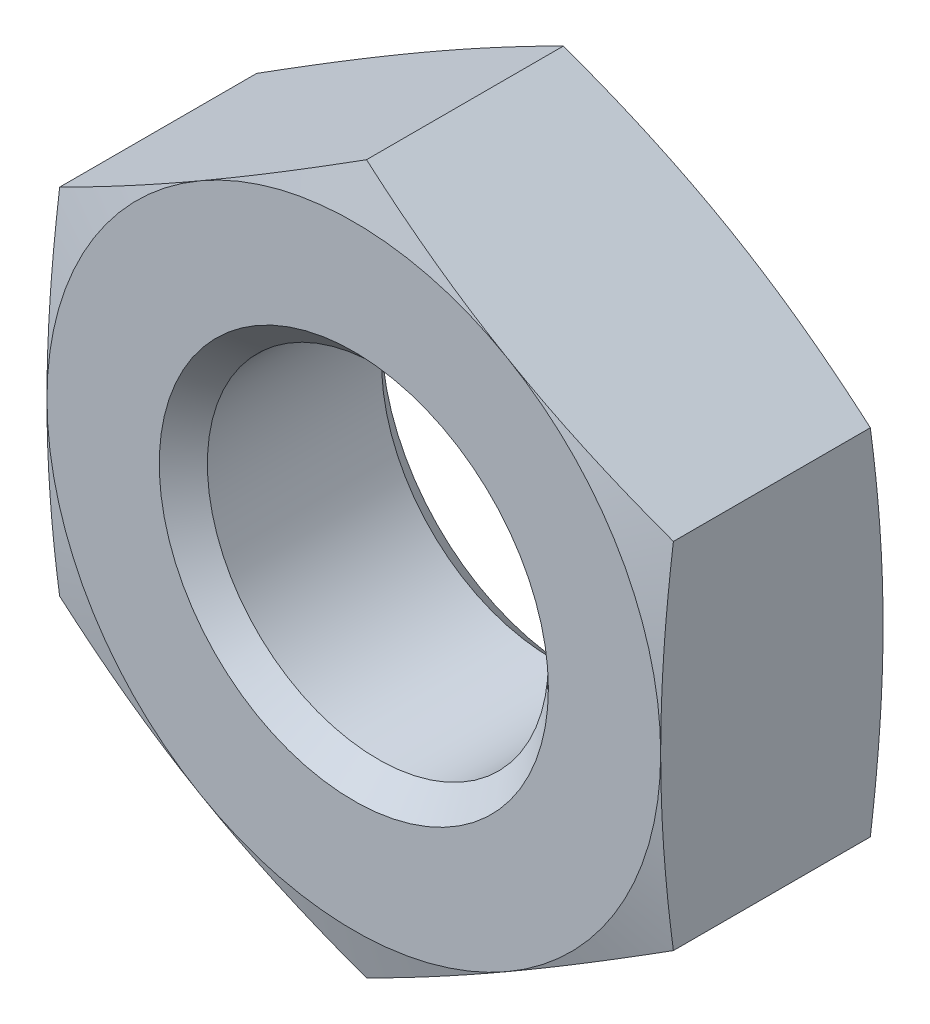
ISO-10303-21;
HEADER;
FILE_DESCRIPTION(('STEP AP214'),'2;1');
FILE_NAME('part.step','',(''),(''),'','','');
FILE_SCHEMA(('AUTOMOTIVE_DESIGN { 1 0 10303 214 1 1 1 1 }'));
ENDSEC;
DATA;
#1=APPLICATION_CONTEXT('core data for automotive mechanical design processes');
#2=APPLICATION_PROTOCOL_DEFINITION('international standard','automotive_design',2000,#1);
#3=PRODUCT_CONTEXT('',#1,'mechanical');
#4=PRODUCT('Part','Part','',(#3));
#5=PRODUCT_RELATED_PRODUCT_CATEGORY('part','',(#4));
#6=PRODUCT_DEFINITION_FORMATION('','',#4);
#7=PRODUCT_DEFINITION_CONTEXT('part definition',#1,'design');
#8=PRODUCT_DEFINITION('design','',#6,#7);
#9=PRODUCT_DEFINITION_SHAPE('','',#8);
#10=(LENGTH_UNIT() NAMED_UNIT(*) SI_UNIT(.MILLI.,.METRE.));
#11=(NAMED_UNIT(*) PLANE_ANGLE_UNIT() SI_UNIT($,.RADIAN.));
#12=(NAMED_UNIT(*) SI_UNIT($,.STERADIAN.) SOLID_ANGLE_UNIT());
#13=UNCERTAINTY_MEASURE_WITH_UNIT(LENGTH_MEASURE(1.E-05),#10,'distance_accuracy_value','');
#14=(GEOMETRIC_REPRESENTATION_CONTEXT(3) GLOBAL_UNCERTAINTY_ASSIGNED_CONTEXT((#13)) GLOBAL_UNIT_ASSIGNED_CONTEXT((#10,
#11,#12)) REPRESENTATION_CONTEXT('',''));
#15=CARTESIAN_POINT('',(0.,0.,0.));
#16=DIRECTION('',(0.,0.,1.));
#17=DIRECTION('',(1.,0.,0.));
#18=AXIS2_PLACEMENT_3D('',#15,#16,#17);
#19=CARTESIAN_POINT('',(0.,0.,-0.46960775465478));
#20=DIRECTION('',(0.,0.,-1.));
#21=DIRECTION('',(-1.,0.,0.));
#22=AXIS2_PLACEMENT_3D('',#19,#20,#21);
#23=CONICAL_SURFACE('',#22,10.5156,1.30899693899575);
#24=CARTESIAN_POINT('',(-8.763,-13.3837702899199,-1.93844049434777));
#25=CARTESIAN_POINT('',(-8.763,-12.9862181649756,-1.84934412146664));
#26=CARTESIAN_POINT('',(-8.763,-12.5884173836727,-1.76133740130551));
#27=CARTESIAN_POINT('',(-8.763,-11.792196389762,-1.58809143425452));
#28=CARTESIAN_POINT('',(-8.763,-11.3937761511781,-1.50285230688892));
#29=CARTESIAN_POINT('',(-8.763,-10.5958372220428,-1.33565551527808));
#30=CARTESIAN_POINT('',(-8.763,-10.1963178373504,-1.2537011520015));
#31=CARTESIAN_POINT('',(-8.763,-9.39644750668763,-1.09395849709296));
#32=CARTESIAN_POINT('',(-8.763,-8.99609656776501,-1.0161701703002));
#33=CARTESIAN_POINT('',(-8.763,-8.19761138133054,-0.866351145193688));
#34=CARTESIAN_POINT('',(-8.763,-7.7994848436043,-0.794279558247119));
#35=CARTESIAN_POINT('',(-8.763,-7.00214580050872,-0.656428589692995));
#36=CARTESIAN_POINT('',(-8.763,-6.60293331923369,-0.590649069632863));
#37=CARTESIAN_POINT('',(-8.763,-5.80334489207022,-0.466863323728334));
#38=CARTESIAN_POINT('',(-8.763,-5.40296909562369,-0.408856140943656));
#39=CARTESIAN_POINT('',(-8.763,-4.60094342795015,-0.302324446329907));
#40=CARTESIAN_POINT('',(-8.763,-4.19929355552988,-0.253799943384739));
#41=CARTESIAN_POINT('',(-8.763,-3.39018837962683,-0.167607648360078));
#42=CARTESIAN_POINT('',(-8.763,-2.98271903379171,-0.130069718559839));
#43=CARTESIAN_POINT('',(-8.763,-2.16675595793937,-0.0684401455251191));
#44=CARTESIAN_POINT('',(-8.763,-1.75826225163068,-0.0443481939203276));
#45=CARTESIAN_POINT('',(-8.763,-0.940843012454314,-0.0110157171231371));
#46=CARTESIAN_POINT('',(-8.763,-0.531917760453649,-0.00176844288722009));
#47=CARTESIAN_POINT('',(-8.763,0.285991550994262,0.00130613861734006));
#48=CARTESIAN_POINT('',(-8.763,0.694975610390509,-0.00486654082138649));
#49=CARTESIAN_POINT('',(-8.763,1.51391612064036,-0.0322847373045139));
#50=CARTESIAN_POINT('',(-8.763,1.92387070253099,-0.0535849596048437));
#51=CARTESIAN_POINT('',(-8.763,2.74281574927551,-0.110042389929746));
#52=CARTESIAN_POINT('',(-8.763,3.15180619258268,-0.145199904740592));
#53=CARTESIAN_POINT('',(-8.763,3.96881951949812,-0.22759601433524));
#54=CARTESIAN_POINT('',(-8.763,4.37684159561712,-0.27484249329322));
#55=CARTESIAN_POINT('',(-8.763,5.19157263502939,-0.379450538965934));
#56=CARTESIAN_POINT('',(-8.763,5.59828159419586,-0.436812137438485));
#57=CARTESIAN_POINT('',(-8.763,6.38354017699799,-0.555743213369239));
#58=CARTESIAN_POINT('',(-8.763,6.76217092727843,-0.616782449788006));
#59=CARTESIAN_POINT('',(-8.763,7.51843456139871,-0.744785447310177));
#60=CARTESIAN_POINT('',(-8.763,7.89606741772422,-0.81174937005183));
#61=CARTESIAN_POINT('',(-8.763,8.65047296826483,-0.950519483254617));
#62=CARTESIAN_POINT('',(-8.763,9.02724558226135,-1.02232610765112));
#63=CARTESIAN_POINT('',(-8.763,9.78001835031701,-1.16989133180626));
#64=CARTESIAN_POINT('',(-8.763,10.1560184943023,-1.24564998276803));
#65=CARTESIAN_POINT('',(-8.763,10.9074351141636,-1.40042140295396));
#66=CARTESIAN_POINT('',(-8.763,11.2828514390693,-1.47943490312786));
#67=CARTESIAN_POINT('',(-8.763,12.0331126862545,-1.64013356208892));
#68=CARTESIAN_POINT('',(-8.763,12.4079576051979,-1.72181873641227));
#69=CARTESIAN_POINT('',(-8.763,13.5317125358089,-1.97016081007156));
#70=CARTESIAN_POINT('',(-8.763,14.279893613434,-2.14011488200832));
#71=CARTESIAN_POINT('',(-8.763,15.7674818810842,-2.48445565533592));
#72=CARTESIAN_POINT('',(-8.763,16.5069030435853,-2.65878238911854));
#73=CARTESIAN_POINT('',(-8.763,17.9847143075208,-3.01180428588832));
#74=CARTESIAN_POINT('',(-8.763,18.7231043899121,-3.19049952845809));
#75=CARTESIAN_POINT('',(-8.763,20.1981842908095,-3.5508912153922));
#76=CARTESIAN_POINT('',(-8.763,20.9348750830499,-3.73258368406784));
#77=CARTESIAN_POINT('',(-8.763,22.4076149635126,-4.09844959544106));
#78=CARTESIAN_POINT('',(-8.763,23.1436640721096,-4.2826229560661));
#79=CARTESIAN_POINT('',(-8.763,23.8794895947639,-4.46767540457424));
#80=B_SPLINE_CURVE_WITH_KNOTS('',3,(#24,#25,#26,#27,#28,#29,#30,#31,#32,#33,#34,#35,#36,#37,#38,
#39,#40,#41,#42,#43,#44,#45,#46,#47,#48,#49,#50,#51,#52,#53,#54,#55,#56,#57,#58,#59,#60,#61,#62,
#63,#64,#65,#66,#67,#68,#69,#70,#71,#72,#73,#74,#75,#76,#77,#78,#79),.UNSPECIFIED.,.F.,.F.,(4,2,
2,2,2,2,2,2,2,2,2,2,2,2,2,2,2,2,2,2,2,2,2,2,2,2,2,4),(0.,1.22224582683769,2.44454436889226,
3.66804192292283,4.89152914916844,6.10528101679588,7.31900617050677,8.53258175121245,
9.74615846885785,10.9735486088279,12.2009105986532,13.4277144175138,14.6545171788198,
15.8857791275233,17.1170683366373,18.3491626232361,19.5812607782343,20.7317631716272,
21.8822969628969,23.0329339862866,24.183585921232,25.3344976849745,26.4854161426325,
28.7870971026554,31.0661607154404,33.345265877679,35.6215585602892,37.8977761229223),.UNSPECIFIED.);
#81=CARTESIAN_POINT('',(-8.763,-5.0593204089087,-0.363242862360831));
#82=VERTEX_POINT('',#81);
#83=CARTESIAN_POINT('',(-8.763,0.,0.));
#84=VERTEX_POINT('',#83);
#85=EDGE_CURVE('E276',#82,#84,#80,.T.);
#86=ORIENTED_EDGE('',*,*,#85,.F.);
#87=CARTESIAN_POINT('',(0.0002,-10.1187562878708,-0.363273802998012));
#88=CARTESIAN_POINT('',(-0.363721959861376,-9.90864584638087,-0.306951649740606));
#89=CARTESIAN_POINT('',(-0.728303743849241,-9.69815445525386,-0.25582046240115));
#90=CARTESIAN_POINT('',(-1.45875483719337,-9.2764283198818,-0.165987801407371));
#91=CARTESIAN_POINT('',(-1.82462460868095,-9.06519330882512,-0.127291376259173));
#92=CARTESIAN_POINT('',(-2.55543344890334,-8.64326062819659,-0.064587273673505));
#93=CARTESIAN_POINT('',(-2.92036757610492,-8.4325658116203,-0.0405048202732206));
#94=CARTESIAN_POINT('',(-3.65070120469056,-8.01090749455818,-0.00821271888188956));
#95=CARTESIAN_POINT('',(-4.01610060234528,-7.79994405396051,0.));
#96=CARTESIAN_POINT('',(-4.74689939765473,-7.37801717276518,0.));
#97=CARTESIAN_POINT('',(-5.11229879530945,-7.16705373216752,-0.00821271888191001));
#98=CARTESIAN_POINT('',(-5.84263242389508,-6.7453954151054,-0.0405048202732604));
#99=CARTESIAN_POINT('',(-6.20756655109666,-6.5347005985291,-0.064587273673554));
#100=CARTESIAN_POINT('',(-6.93837539131905,-6.11276791790058,-0.127291376259239));
#101=CARTESIAN_POINT('',(-7.30424516280663,-5.9015329068439,-0.165987801407446));
#102=CARTESIAN_POINT('',(-8.03469625615076,-5.47980677147184,-0.255820462401241));
#103=CARTESIAN_POINT('',(-8.39927804013863,-5.26931538034483,-0.306951649740704));
#104=CARTESIAN_POINT('',(-8.7632,-5.05920493885486,-0.363273802998116));
#105=B_SPLINE_CURVE_WITH_KNOTS('',3,(#87,#88,#89,#90,#91,#92,#93,#94,#95,#96,#97,#98,#99,#100,
#101,#102,#103,#104),.UNSPECIFIED.,.F.,.F.,(4,2,2,2,2,2,2,2,4),(0.,1.27200216485818,
2.5445201112656,3.81047076613488,5.07617642725257,6.34188208837027,7.60783274323955,
8.88035068964697,10.1523528545051),.UNSPECIFIED.);
#106=CARTESIAN_POINT('',(-4.38149999999967,-7.58898061336304,0.));
#107=VERTEX_POINT('',#106);
#108=EDGE_CURVE('E152',#107,#82,#105,.T.);
#109=ORIENTED_EDGE('',*,*,#108,.F.);
#110=CARTESIAN_POINT('',(0.,0.,0.));
#111=DIRECTION('',(0.,0.,1.));
#112=DIRECTION('',(1.,0.,0.));
#113=AXIS2_PLACEMENT_3D('',#110,#111,#112);
#114=CIRCLE('',#113,8.763);
#115=EDGE_CURVE('E256',#84,#107,#114,.T.);
#116=ORIENTED_EDGE('',*,*,#115,.F.);
#117=EDGE_LOOP('',(#86,#109,#116));
#118=FACE_BOUND('',#117,.T.);
#119=ADVANCED_FACE('F33',(#118),#23,.T.);
#120=CARTESIAN_POINT('',(-8.763,5.0593204089087,-0.363242862360831));
#121=VERTEX_POINT('',#120);
#122=EDGE_CURVE('E273',#84,#121,#80,.T.);
#123=ORIENTED_EDGE('',*,*,#122,.F.);
#124=CARTESIAN_POINT('',(-4.38149999999967,7.58898061336304,0.));
#125=VERTEX_POINT('',#124);
#126=EDGE_CURVE('E257',#125,#84,#114,.T.);
#127=ORIENTED_EDGE('',*,*,#126,.F.);
#128=CARTESIAN_POINT('',(-8.7632,5.05920493885486,-0.363273802998116));
#129=CARTESIAN_POINT('',(-8.39927804013863,5.26931538034483,-0.306951649740704));
#130=CARTESIAN_POINT('',(-8.03469625615076,5.47980677147184,-0.255820462401241));
#131=CARTESIAN_POINT('',(-7.30424516280663,5.9015329068439,-0.165987801407446));
#132=CARTESIAN_POINT('',(-6.93837539131905,6.11276791790058,-0.127291376259239));
#133=CARTESIAN_POINT('',(-6.20756655109666,6.5347005985291,-0.0645872736735539));
#134=CARTESIAN_POINT('',(-5.84263242389508,6.7453954151054,-0.0405048202732603));
#135=CARTESIAN_POINT('',(-5.11229879530945,7.16705373216752,-0.00821271888190981));
#136=CARTESIAN_POINT('',(-4.74689939765473,7.37801717276518,0.));
#137=CARTESIAN_POINT('',(-4.01610060234528,7.79994405396051,0.));
#138=CARTESIAN_POINT('',(-3.65070120469056,8.01090749455818,-0.00821271888188968));
#139=CARTESIAN_POINT('',(-2.92036757610492,8.4325658116203,-0.0405048202732207));
#140=CARTESIAN_POINT('',(-2.55543344890334,8.64326062819659,-0.064587273673505));
#141=CARTESIAN_POINT('',(-1.82462460868095,9.06519330882512,-0.127291376259173));
#142=CARTESIAN_POINT('',(-1.45875483719337,9.2764283198818,-0.165987801407371));
#143=CARTESIAN_POINT('',(-0.72830374384924,9.69815445525386,-0.25582046240115));
#144=CARTESIAN_POINT('',(-0.363721959861375,9.90864584638087,-0.306951649740606));
#145=CARTESIAN_POINT('',(0.000200000000000236,10.1187562878708,-0.363273802998012));
#146=B_SPLINE_CURVE_WITH_KNOTS('',3,(#128,#129,#130,#131,#132,#133,#134,#135,#136,#137,#138,
#139,#140,#141,#142,#143,#144,#145),.UNSPECIFIED.,.F.,.F.,(4,2,2,2,2,2,2,2,4),(0.,
1.27200216485818,2.5445201112656,3.81047076613488,5.07617642725257,6.34188208837027,
7.60783274323955,8.88035068964697,10.1523528545051),.UNSPECIFIED.);
#147=EDGE_CURVE('E268',#121,#125,#146,.T.);
#148=ORIENTED_EDGE('',*,*,#147,.F.);
#149=EDGE_LOOP('',(#123,#127,#148));
#150=FACE_BOUND('',#149,.T.);
#151=ADVANCED_FACE('F222',(#150),#23,.T.);
#152=CARTESIAN_POINT('',(0.,10.118640817817,-0.363242862360727));
#153=VERTEX_POINT('',#152);
#154=EDGE_CURVE('E265',#125,#153,#146,.T.);
#155=ORIENTED_EDGE('',*,*,#154,.F.);
#156=CARTESIAN_POINT('',(4.38149999999967,7.58898061336304,0.));
#157=VERTEX_POINT('',#156);
#158=EDGE_CURVE('E41',#157,#125,#114,.T.);
#159=ORIENTED_EDGE('',*,*,#158,.F.);
#160=CARTESIAN_POINT('',(-0.0002,10.1187562878708,-0.363273802998012));
#161=CARTESIAN_POINT('',(0.363721959861376,9.90864584638087,-0.306951649740606));
#162=CARTESIAN_POINT('',(0.728303743849241,9.69815445525386,-0.25582046240115));
#163=CARTESIAN_POINT('',(1.45875483719337,9.2764283198818,-0.165987801407371));
#164=CARTESIAN_POINT('',(1.82462460868095,9.06519330882512,-0.127291376259173));
#165=CARTESIAN_POINT('',(2.55543344890334,8.64326062819659,-0.064587273673505));
#166=CARTESIAN_POINT('',(2.92036757610492,8.4325658116203,-0.0405048202732206));
#167=CARTESIAN_POINT('',(3.65070120469056,8.01090749455818,-0.00821271888188956));
#168=CARTESIAN_POINT('',(4.01610060234528,7.79994405396051,0.));
#169=CARTESIAN_POINT('',(4.74689939765473,7.37801717276518,0.));
#170=CARTESIAN_POINT('',(5.11229879530945,7.16705373216752,-0.00821271888191001));
#171=CARTESIAN_POINT('',(5.84263242389508,6.7453954151054,-0.0405048202732604));
#172=CARTESIAN_POINT('',(6.20756655109666,6.5347005985291,-0.064587273673554));
#173=CARTESIAN_POINT('',(6.93837539131905,6.11276791790058,-0.127291376259239));
#174=CARTESIAN_POINT('',(7.30424516280663,5.9015329068439,-0.165987801407446));
#175=CARTESIAN_POINT('',(8.03469625615076,5.47980677147184,-0.255820462401241));
#176=CARTESIAN_POINT('',(8.39927804013863,5.26931538034483,-0.306951649740704));
#177=CARTESIAN_POINT('',(8.7632,5.05920493885486,-0.363273802998116));
#178=B_SPLINE_CURVE_WITH_KNOTS('',3,(#160,#161,#162,#163,#164,#165,#166,#167,#168,#169,#170,
#171,#172,#173,#174,#175,#176,#177),.UNSPECIFIED.,.F.,.F.,(4,2,2,2,2,2,2,2,4),(0.,
1.27200216485818,2.5445201112656,3.81047076613488,5.07617642725257,6.34188208837027,
7.60783274323955,8.88035068964697,10.1523528545051),.UNSPECIFIED.);
#179=EDGE_CURVE('E264',#153,#157,#178,.T.);
#180=ORIENTED_EDGE('',*,*,#179,.F.);
#181=EDGE_LOOP('',(#155,#159,#180));
#182=FACE_BOUND('',#181,.T.);
#183=ADVANCED_FACE('F228',(#182),#23,.T.);
#184=CARTESIAN_POINT('',(8.763,5.0593204089087,-0.363242862360831));
#185=VERTEX_POINT('',#184);
#186=EDGE_CURVE('E326',#157,#185,#178,.T.);
#187=ORIENTED_EDGE('',*,*,#186,.F.);
#188=CARTESIAN_POINT('',(8.763,0.,0.));
#189=VERTEX_POINT('',#188);
#190=EDGE_CURVE('E11',#189,#157,#114,.T.);
#191=ORIENTED_EDGE('',*,*,#190,.F.);
#192=CARTESIAN_POINT('',(8.763,-13.3837702899199,-1.93844049434777));
#193=CARTESIAN_POINT('',(8.763,-12.9862181649756,-1.84934412146664));
#194=CARTESIAN_POINT('',(8.763,-12.5884173836727,-1.76133740130551));
#195=CARTESIAN_POINT('',(8.763,-11.792196389762,-1.58809143425452));
#196=CARTESIAN_POINT('',(8.763,-11.3937761511781,-1.50285230688892));
#197=CARTESIAN_POINT('',(8.763,-10.5958372220428,-1.33565551527808));
#198=CARTESIAN_POINT('',(8.763,-10.1963178373504,-1.2537011520015));
#199=CARTESIAN_POINT('',(8.763,-9.39644750668763,-1.09395849709296));
#200=CARTESIAN_POINT('',(8.763,-8.99609656776501,-1.0161701703002));
#201=CARTESIAN_POINT('',(8.763,-8.19761138133054,-0.866351145193688));
#202=CARTESIAN_POINT('',(8.763,-7.7994848436043,-0.794279558247119));
#203=CARTESIAN_POINT('',(8.763,-7.00214580050872,-0.656428589692995));
#204=CARTESIAN_POINT('',(8.763,-6.60293331923369,-0.590649069632863));
#205=CARTESIAN_POINT('',(8.763,-5.80334489207022,-0.466863323728334));
#206=CARTESIAN_POINT('',(8.763,-5.40296909562369,-0.408856140943656));
#207=CARTESIAN_POINT('',(8.763,-4.60094342795015,-0.302324446329907));
#208=CARTESIAN_POINT('',(8.763,-4.19929355552988,-0.253799943384739));
#209=CARTESIAN_POINT('',(8.763,-3.39018837962683,-0.167607648360078));
#210=CARTESIAN_POINT('',(8.763,-2.98271903379171,-0.130069718559839));
#211=CARTESIAN_POINT('',(8.763,-2.16675595793937,-0.0684401455251191));
#212=CARTESIAN_POINT('',(8.763,-1.75826225163068,-0.0443481939203276));
#213=CARTESIAN_POINT('',(8.763,-0.940843012454314,-0.0110157171231371));
#214=CARTESIAN_POINT('',(8.763,-0.531917760453649,-0.00176844288722009));
#215=CARTESIAN_POINT('',(8.763,0.285991550994262,0.00130613861734006));
#216=CARTESIAN_POINT('',(8.763,0.694975610390509,-0.00486654082138649));
#217=CARTESIAN_POINT('',(8.763,1.51391612064036,-0.0322847373045139));
#218=CARTESIAN_POINT('',(8.763,1.92387070253099,-0.0535849596048437));
#219=CARTESIAN_POINT('',(8.763,2.74281574927551,-0.110042389929746));
#220=CARTESIAN_POINT('',(8.763,3.15180619258268,-0.145199904740592));
#221=CARTESIAN_POINT('',(8.763,3.96881951949812,-0.22759601433524));
#222=CARTESIAN_POINT('',(8.763,4.37684159561712,-0.27484249329322));
#223=CARTESIAN_POINT('',(8.763,5.19157263502939,-0.379450538965934));
#224=CARTESIAN_POINT('',(8.763,5.59828159419586,-0.436812137438485));
#225=CARTESIAN_POINT('',(8.763,6.38354017699799,-0.555743213369239));
#226=CARTESIAN_POINT('',(8.763,6.76217092727843,-0.616782449788006));
#227=CARTESIAN_POINT('',(8.763,7.51843456139871,-0.744785447310177));
#228=CARTESIAN_POINT('',(8.763,7.89606741772422,-0.81174937005183));
#229=CARTESIAN_POINT('',(8.763,8.65047296826483,-0.950519483254617));
#230=CARTESIAN_POINT('',(8.763,9.02724558226135,-1.02232610765112));
#231=CARTESIAN_POINT('',(8.763,9.78001835031701,-1.16989133180626));
#232=CARTESIAN_POINT('',(8.763,10.1560184943023,-1.24564998276803));
#233=CARTESIAN_POINT('',(8.763,10.9074351141636,-1.40042140295396));
#234=CARTESIAN_POINT('',(8.763,11.2828514390693,-1.47943490312786));
#235=CARTESIAN_POINT('',(8.763,12.0331126862545,-1.64013356208892));
#236=CARTESIAN_POINT('',(8.763,12.4079576051979,-1.72181873641227));
#237=CARTESIAN_POINT('',(8.763,13.5317125358089,-1.97016081007156));
#238=CARTESIAN_POINT('',(8.763,14.279893613434,-2.14011488200832));
#239=CARTESIAN_POINT('',(8.763,15.7674818810842,-2.48445565533592));
#240=CARTESIAN_POINT('',(8.763,16.5069030435853,-2.65878238911854));
#241=CARTESIAN_POINT('',(8.763,17.9847143075208,-3.01180428588832));
#242=CARTESIAN_POINT('',(8.763,18.7231043899121,-3.19049952845809));
#243=CARTESIAN_POINT('',(8.763,20.1981842908095,-3.5508912153922));
#244=CARTESIAN_POINT('',(8.763,20.9348750830499,-3.73258368406784));
#245=CARTESIAN_POINT('',(8.763,22.4076149635126,-4.09844959544106));
#246=CARTESIAN_POINT('',(8.763,23.1436640721096,-4.2826229560661));
#247=CARTESIAN_POINT('',(8.763,23.8794895947639,-4.46767540457424));
#248=B_SPLINE_CURVE_WITH_KNOTS('',3,(#192,#193,#194,#195,#196,#197,#198,#199,#200,#201,#202,
#203,#204,#205,#206,#207,#208,#209,#210,#211,#212,#213,#214,#215,#216,#217,#218,#219,#220,#221,
#222,#223,#224,#225,#226,#227,#228,#229,#230,#231,#232,#233,#234,#235,#236,#237,#238,#239,#240,
#241,#242,#243,#244,#245,#246,#247),.UNSPECIFIED.,.F.,.F.,(4,2,2,2,2,2,2,2,2,2,2,2,2,2,2,2,2,2,
2,2,2,2,2,2,2,2,2,4),(0.,1.22224582683769,2.44454436889226,3.66804192292283,4.89152914916844,
6.10528101679588,7.31900617050677,8.53258175121245,9.74615846885785,10.9735486088279,
12.2009105986532,13.4277144175138,14.6545171788198,15.8857791275233,17.1170683366373,
18.3491626232361,19.5812607782343,20.7317631716272,21.8822969628969,23.0329339862866,
24.183585921232,25.3344976849745,26.4854161426325,28.7870971026554,31.0661607154404,
33.345265877679,35.6215585602892,37.8977761229223),.UNSPECIFIED.);
#249=EDGE_CURVE('E324',#185,#189,#248,.F.);
#250=ORIENTED_EDGE('',*,*,#249,.F.);
#251=EDGE_LOOP('',(#187,#191,#250));
#252=FACE_BOUND('',#251,.T.);
#253=ADVANCED_FACE('F240',(#252),#23,.T.);
#254=CARTESIAN_POINT('',(8.763,-5.0593204089087,-0.363242862360831));
#255=VERTEX_POINT('',#254);
#256=EDGE_CURVE('E250',#189,#255,#248,.F.);
#257=ORIENTED_EDGE('',*,*,#256,.F.);
#258=CARTESIAN_POINT('',(4.38149999999967,-7.58898061336304,0.));
#259=VERTEX_POINT('',#258);
#260=EDGE_CURVE('E42',#259,#189,#114,.T.);
#261=ORIENTED_EDGE('',*,*,#260,.F.);
#262=CARTESIAN_POINT('',(8.7632,-5.05920493885486,-0.363273802998116));
#263=CARTESIAN_POINT('',(8.39927804013863,-5.26931538034483,-0.306951649740704));
#264=CARTESIAN_POINT('',(8.03469625615076,-5.47980677147184,-0.255820462401241));
#265=CARTESIAN_POINT('',(7.30424516280663,-5.9015329068439,-0.165987801407446));
#266=CARTESIAN_POINT('',(6.93837539131905,-6.11276791790058,-0.127291376259239));
#267=CARTESIAN_POINT('',(6.20756655109666,-6.5347005985291,-0.0645872736735539));
#268=CARTESIAN_POINT('',(5.84263242389508,-6.7453954151054,-0.0405048202732603));
#269=CARTESIAN_POINT('',(5.11229879530945,-7.16705373216752,-0.00821271888190981));
#270=CARTESIAN_POINT('',(4.74689939765473,-7.37801717276518,0.));
#271=CARTESIAN_POINT('',(4.01610060234528,-7.79994405396051,0.));
#272=CARTESIAN_POINT('',(3.65070120469056,-8.01090749455818,-0.00821271888188968));
#273=CARTESIAN_POINT('',(2.92036757610492,-8.4325658116203,-0.0405048202732207));
#274=CARTESIAN_POINT('',(2.55543344890334,-8.64326062819659,-0.064587273673505));
#275=CARTESIAN_POINT('',(1.82462460868095,-9.06519330882512,-0.127291376259173));
#276=CARTESIAN_POINT('',(1.45875483719337,-9.2764283198818,-0.165987801407371));
#277=CARTESIAN_POINT('',(0.72830374384924,-9.69815445525386,-0.25582046240115));
#278=CARTESIAN_POINT('',(0.363721959861375,-9.90864584638087,-0.306951649740606));
#279=CARTESIAN_POINT('',(-0.000200000000000236,-10.1187562878708,-0.363273802998012));
#280=B_SPLINE_CURVE_WITH_KNOTS('',3,(#262,#263,#264,#265,#266,#267,#268,#269,#270,#271,#272,
#273,#274,#275,#276,#277,#278,#279),.UNSPECIFIED.,.F.,.F.,(4,2,2,2,2,2,2,2,4),(0.,
1.27200216485818,2.5445201112656,3.81047076613488,5.07617642725257,6.34188208837027,
7.60783274323955,8.88035068964697,10.1523528545051),.UNSPECIFIED.);
#281=EDGE_CURVE('E144',#255,#259,#280,.T.);
#282=ORIENTED_EDGE('',*,*,#281,.F.);
#283=EDGE_LOOP('',(#257,#261,#282));
#284=FACE_BOUND('',#283,.T.);
#285=ADVANCED_FACE('F233',(#284),#23,.T.);
#286=CARTESIAN_POINT('',(0.,-10.118640817817,-0.363242862360727));
#287=VERTEX_POINT('',#286);
#288=EDGE_CURVE('E136',#259,#287,#280,.T.);
#289=ORIENTED_EDGE('',*,*,#288,.F.);
#290=EDGE_CURVE('E245',#107,#259,#114,.T.);
#291=ORIENTED_EDGE('',*,*,#290,.F.);
#292=EDGE_CURVE('E49',#287,#107,#105,.T.);
#293=ORIENTED_EDGE('',*,*,#292,.F.);
#294=EDGE_LOOP('',(#289,#291,#293));
#295=FACE_BOUND('',#294,.T.);
#296=ADVANCED_FACE('F224',(#295),#23,.T.);
#297=CARTESIAN_POINT('',(0.,0.,0.));
#298=DIRECTION('',(0.,0.,-1.));
#299=DIRECTION('',(-1.,0.,0.));
#300=AXIS2_PLACEMENT_3D('',#297,#298,#299);
#301=PLANE('',#300);
#302=CARTESIAN_POINT('',(0.,0.,0.));
#303=DIRECTION('',(0.,0.,1.));
#304=DIRECTION('',(1.,0.,0.));
#305=AXIS2_PLACEMENT_3D('',#302,#303,#304);
#306=CIRCLE('',#305,5.55625);
#307=CARTESIAN_POINT('',(5.55625,0.,0.));
#308=VERTEX_POINT('',#307);
#309=EDGE_CURVE('E183',#308,#308,#306,.T.);
#310=ORIENTED_EDGE('',*,*,#309,.F.);
#311=EDGE_LOOP('',(#310));
#312=FACE_BOUND('',#311,.T.);
#313=ORIENTED_EDGE('',*,*,#190,.T.);
#314=ORIENTED_EDGE('',*,*,#158,.T.);
#315=ORIENTED_EDGE('',*,*,#126,.T.);
#316=ORIENTED_EDGE('',*,*,#115,.T.);
#317=ORIENTED_EDGE('',*,*,#290,.T.);
#318=ORIENTED_EDGE('',*,*,#260,.T.);
#319=EDGE_LOOP('',(#313,#314,#315,#316,#317,#318));
#320=FACE_BOUND('',#319,.T.);
#321=ADVANCED_FACE('F35',(#312,#320),#301,.F.);
#322=CARTESIAN_POINT('',(-8.763,5.0593204089087,-6.35));
#323=DIRECTION('',(-1.,0.,0.));
#324=DIRECTION('',(0.,0.,1.));
#325=AXIS2_PLACEMENT_3D('',#322,#323,#324);
#326=PLANE('',#325);
#327=ORIENTED_EDGE('',*,*,#85,.T.);
#328=ORIENTED_EDGE('',*,*,#122,.T.);
#329=DIRECTION('',(0.,0.,1.));
#330=VECTOR('',#329,1.);
#331=CARTESIAN_POINT('',(-8.763,5.0593204089087,-6.35));
#332=LINE('',#331,#330);
#333=CARTESIAN_POINT('',(-8.763,5.0593204089087,-5.98675713763915));
#334=VERTEX_POINT('',#333);
#335=EDGE_CURVE('E129',#334,#121,#332,.T.);
#336=ORIENTED_EDGE('',*,*,#335,.F.);
#337=CARTESIAN_POINT('',(-8.763,-13.3837702899199,-4.41155950565215));
#338=CARTESIAN_POINT('',(-8.763,-12.9862181649756,-4.50065587853328));
#339=CARTESIAN_POINT('',(-8.763,-12.5884173836727,-4.58866259869441));
#340=CARTESIAN_POINT('',(-8.763,-11.792196389762,-4.76190856574541));
#341=CARTESIAN_POINT('',(-8.763,-11.3937761511781,-4.84714769311101));
#342=CARTESIAN_POINT('',(-8.763,-10.5958372220428,-5.01434448472186));
#343=CARTESIAN_POINT('',(-8.763,-10.1963178373504,-5.09629884799844));
#344=CARTESIAN_POINT('',(-8.763,-9.39644750668763,-5.25604150290699));
#345=CARTESIAN_POINT('',(-8.763,-8.99609656776501,-5.33382982969976));
#346=CARTESIAN_POINT('',(-8.763,-8.19761138133054,-5.48364885480628));
#347=CARTESIAN_POINT('',(-8.763,-7.7994848436043,-5.55572044175285));
#348=CARTESIAN_POINT('',(-8.763,-7.00214580050872,-5.69357141030698));
#349=CARTESIAN_POINT('',(-8.763,-6.6029333192337,-5.75935093036711));
#350=CARTESIAN_POINT('',(-8.763,-5.80334489207023,-5.88313667627165));
#351=CARTESIAN_POINT('',(-8.763,-5.4029690956237,-5.94114385905633));
#352=CARTESIAN_POINT('',(-8.763,-4.60094342795016,-6.04767555367008));
#353=CARTESIAN_POINT('',(-8.763,-4.19929355552989,-6.09620005661525));
#354=CARTESIAN_POINT('',(-8.763,-3.39018837962684,-6.18239235163991));
#355=CARTESIAN_POINT('',(-8.763,-2.98271903379172,-6.21993028144016));
#356=CARTESIAN_POINT('',(-8.763,-2.16675595793937,-6.28155985447488));
#357=CARTESIAN_POINT('',(-8.763,-1.75826225163068,-6.30565180607967));
#358=CARTESIAN_POINT('',(-8.763,-0.940843012454313,-6.33898428287686));
#359=CARTESIAN_POINT('',(-8.763,-0.531917760453646,-6.34823155711278));
#360=CARTESIAN_POINT('',(-8.763,0.285991550994266,-6.35130613861734));
#361=CARTESIAN_POINT('',(-8.763,0.694975610390515,-6.34513345917861));
#362=CARTESIAN_POINT('',(-8.763,1.51391612064037,-6.31771526269548));
#363=CARTESIAN_POINT('',(-8.763,1.923870702531,-6.29641504039515));
#364=CARTESIAN_POINT('',(-8.763,2.74281574927552,-6.23995761007025));
#365=CARTESIAN_POINT('',(-8.763,3.15180619258269,-6.2048000952594));
#366=CARTESIAN_POINT('',(-8.763,3.96881951949813,-6.12240398566475));
#367=CARTESIAN_POINT('',(-8.763,4.37684159561714,-6.07515750670677));
#368=CARTESIAN_POINT('',(-8.763,5.19157263502941,-5.97054946103405));
#369=CARTESIAN_POINT('',(-8.763,5.59828159419588,-5.91318786256149));
#370=CARTESIAN_POINT('',(-8.763,6.38354017699802,-5.79425678663073));
#371=CARTESIAN_POINT('',(-8.763,6.76217092727845,-5.73321755021196));
#372=CARTESIAN_POINT('',(-8.763,7.51843456139873,-5.60521455268979));
#373=CARTESIAN_POINT('',(-8.763,7.89606741772424,-5.53825062994813));
#374=CARTESIAN_POINT('',(-8.763,8.65047296826485,-5.39948051674534));
#375=CARTESIAN_POINT('',(-8.763,9.02724558226137,-5.32767389234883));
#376=CARTESIAN_POINT('',(-8.763,9.78001835031703,-5.18010866819369));
#377=CARTESIAN_POINT('',(-8.763,10.1560184943023,-5.10435001723192));
#378=CARTESIAN_POINT('',(-8.763,10.9074351141636,-4.94957859704598));
#379=CARTESIAN_POINT('',(-8.763,11.2828514390693,-4.87056509687208));
#380=CARTESIAN_POINT('',(-8.763,12.0331126862545,-4.70986643791101));
#381=CARTESIAN_POINT('',(-8.763,12.4079576051979,-4.62818126358765));
#382=CARTESIAN_POINT('',(-8.763,13.5317125358089,-4.37983918992835));
#383=CARTESIAN_POINT('',(-8.763,14.279893613434,-4.20988511799159));
#384=CARTESIAN_POINT('',(-8.763,15.7674818810842,-3.86554434466397));
#385=CARTESIAN_POINT('',(-8.763,16.5069030435853,-3.69121761088135));
#386=CARTESIAN_POINT('',(-8.763,17.9847143075208,-3.33819571411155));
#387=CARTESIAN_POINT('',(-8.763,18.7231043899121,-3.15950047154178));
#388=CARTESIAN_POINT('',(-8.763,20.1981842908095,-2.79910878460765));
#389=CARTESIAN_POINT('',(-8.763,20.9348750830499,-2.617416315932));
#390=CARTESIAN_POINT('',(-8.763,22.4076149635126,-2.25155040455877));
#391=CARTESIAN_POINT('',(-8.763,23.1436640721096,-2.06737704393372));
#392=CARTESIAN_POINT('',(-8.763,23.8794895947639,-1.88232459542558));
#393=B_SPLINE_CURVE_WITH_KNOTS('',3,(#337,#338,#339,#340,#341,#342,#343,#344,#345,#346,#347,
#348,#349,#350,#351,#352,#353,#354,#355,#356,#357,#358,#359,#360,#361,#362,#363,#364,#365,#366,
#367,#368,#369,#370,#371,#372,#373,#374,#375,#376,#377,#378,#379,#380,#381,#382,#383,#384,#385,
#386,#387,#388,#389,#390,#391,#392),.UNSPECIFIED.,.F.,.F.,(4,2,2,2,2,2,2,2,2,2,2,2,2,2,2,2,2,2,
2,2,2,2,2,2,2,2,2,4),(0.,1.22224582683769,2.44454436889226,3.66804192292284,4.89152914916844,
6.1052810167959,7.31900617050678,8.53258175121246,9.74615846885786,10.9735486088279,
12.2009105986532,13.4277144175139,14.6545171788198,15.8857791275233,17.1170683366373,
18.3491626232362,19.5812607782343,20.7317631716272,21.8822969628969,23.0329339862866,
24.1835859212321,25.3344976849746,26.4854161426326,28.7870971026554,31.0661607154405,
33.345265877679,35.6215585602892,37.8977761229224),.UNSPECIFIED.);
#394=CARTESIAN_POINT('',(-8.763,0.,-6.35));
#395=VERTEX_POINT('',#394);
#396=EDGE_CURVE('E277',#334,#395,#393,.F.);
#397=ORIENTED_EDGE('',*,*,#396,.T.);
#398=CARTESIAN_POINT('',(-8.763,-5.0593204089087,-5.98675713763915));
#399=VERTEX_POINT('',#398);
#400=EDGE_CURVE('E280',#395,#399,#393,.F.);
#401=ORIENTED_EDGE('',*,*,#400,.T.);
#402=DIRECTION('',(0.,0.,1.));
#403=VECTOR('',#402,1.);
#404=CARTESIAN_POINT('',(-8.763,-5.0593204089087,-6.35));
#405=LINE('',#404,#403);
#406=EDGE_CURVE('E138',#399,#82,#405,.T.);
#407=ORIENTED_EDGE('',*,*,#406,.T.);
#408=EDGE_LOOP('',(#327,#328,#336,#397,#401,#407));
#409=FACE_BOUND('',#408,.T.);
#410=ADVANCED_FACE('F175',(#409),#326,.T.);
#411=CARTESIAN_POINT('',(0.,10.118640817817,-6.35));
#412=DIRECTION('',(-0.499999999999971,0.866025403784455,0.));
#413=DIRECTION('',(-0.866025403784455,-0.499999999999971,0.));
#414=AXIS2_PLACEMENT_3D('',#411,#412,#413);
#415=PLANE('',#414);
#416=ORIENTED_EDGE('',*,*,#147,.T.);
#417=ORIENTED_EDGE('',*,*,#154,.T.);
#418=DIRECTION('',(0.,0.,1.));
#419=VECTOR('',#418,1.);
#420=CARTESIAN_POINT('',(0.,10.118640817817,-6.35));
#421=LINE('',#420,#419);
#422=CARTESIAN_POINT('',(0.,10.118640817817,-5.98675713763926));
#423=VERTEX_POINT('',#422);
#424=EDGE_CURVE('E190',#423,#153,#421,.T.);
#425=ORIENTED_EDGE('',*,*,#424,.F.);
#426=CARTESIAN_POINT('',(0.000200000000000055,10.1187562878708,-5.98672619700197));
#427=CARTESIAN_POINT('',(-0.363721959861375,9.90864584638087,-6.04304835025938));
#428=CARTESIAN_POINT('',(-0.72830374384924,9.69815445525386,-6.09417953759884));
#429=CARTESIAN_POINT('',(-1.45875483719337,9.2764283198818,-6.18401219859262));
#430=CARTESIAN_POINT('',(-1.82462460868095,9.06519330882512,-6.22270862374082));
#431=CARTESIAN_POINT('',(-2.55543344890334,8.64326062819659,-6.28541272632649));
#432=CARTESIAN_POINT('',(-2.92036757610492,8.4325658116203,-6.30949517972678));
#433=CARTESIAN_POINT('',(-3.65070120469056,8.01090749455818,-6.34178728111811));
#434=CARTESIAN_POINT('',(-4.01610060234528,7.79994405396051,-6.35000000000005));
#435=CARTESIAN_POINT('',(-4.74689939765473,7.37801717276518,-6.35000000000004));
#436=CARTESIAN_POINT('',(-5.11229879530945,7.16705373216752,-6.34178728111809));
#437=CARTESIAN_POINT('',(-5.84263242389508,6.7453954151054,-6.30949517972674));
#438=CARTESIAN_POINT('',(-6.20756655109666,6.5347005985291,-6.28541272632644));
#439=CARTESIAN_POINT('',(-6.93837539131905,6.11276791790058,-6.22270862374075));
#440=CARTESIAN_POINT('',(-7.30424516280663,5.9015329068439,-6.18401219859255));
#441=CARTESIAN_POINT('',(-8.03469625615076,5.47980677147184,-6.09417953759875));
#442=CARTESIAN_POINT('',(-8.39927804013863,5.26931538034483,-6.04304835025928));
#443=CARTESIAN_POINT('',(-8.7632,5.05920493885486,-5.98672619700187));
#444=B_SPLINE_CURVE_WITH_KNOTS('',3,(#426,#427,#428,#429,#430,#431,#432,#433,#434,#435,#436,
#437,#438,#439,#440,#441,#442,#443),.UNSPECIFIED.,.F.,.F.,(4,2,2,2,2,2,2,2,4),(0.,
1.27200216485818,2.5445201112656,3.81047076613488,5.07617642725258,6.34188208837027,
7.60783274323955,8.88035068964697,10.1523528545052),.UNSPECIFIED.);
#445=CARTESIAN_POINT('',(-4.38149999999967,7.58898061336304,-6.35));
#446=VERTEX_POINT('',#445);
#447=EDGE_CURVE('E269',#423,#446,#444,.T.);
#448=ORIENTED_EDGE('',*,*,#447,.T.);
#449=EDGE_CURVE('E316',#446,#334,#444,.T.);
#450=ORIENTED_EDGE('',*,*,#449,.T.);
#451=ORIENTED_EDGE('',*,*,#335,.T.);
#452=EDGE_LOOP('',(#416,#417,#425,#448,#450,#451));
#453=FACE_BOUND('',#452,.T.);
#454=ADVANCED_FACE('F341',(#453),#415,.T.);
#455=CARTESIAN_POINT('',(8.763,5.0593204089087,-6.35));
#456=DIRECTION('',(0.499999999999971,0.866025403784455,0.));
#457=DIRECTION('',(-0.866025403784455,0.499999999999971,0.));
#458=AXIS2_PLACEMENT_3D('',#455,#456,#457);
#459=PLANE('',#458);
#460=ORIENTED_EDGE('',*,*,#179,.T.);
#461=ORIENTED_EDGE('',*,*,#186,.T.);
#462=DIRECTION('',(0.,0.,1.));
#463=VECTOR('',#462,1.);
#464=CARTESIAN_POINT('',(8.763,5.0593204089087,-6.35));
#465=LINE('',#464,#463);
#466=CARTESIAN_POINT('',(8.763,5.0593204089087,-5.98675713763915));
#467=VERTEX_POINT('',#466);
#468=EDGE_CURVE('E187',#467,#185,#465,.T.);
#469=ORIENTED_EDGE('',*,*,#468,.F.);
#470=CARTESIAN_POINT('',(8.7632,5.05920493885486,-5.98672619700187));
#471=CARTESIAN_POINT('',(8.39927804013863,5.26931538034483,-6.04304835025928));
#472=CARTESIAN_POINT('',(8.03469625615076,5.47980677147184,-6.09417953759875));
#473=CARTESIAN_POINT('',(7.30424516280663,5.9015329068439,-6.18401219859255));
#474=CARTESIAN_POINT('',(6.93837539131905,6.11276791790058,-6.22270862374075));
#475=CARTESIAN_POINT('',(6.20756655109666,6.5347005985291,-6.28541272632644));
#476=CARTESIAN_POINT('',(5.84263242389508,6.7453954151054,-6.30949517972674));
#477=CARTESIAN_POINT('',(5.11229879530945,7.16705373216752,-6.34178728111809));
#478=CARTESIAN_POINT('',(4.74689939765473,7.37801717276518,-6.35000000000004));
#479=CARTESIAN_POINT('',(4.01610060234528,7.79994405396051,-6.35000000000005));
#480=CARTESIAN_POINT('',(3.65070120469056,8.01090749455818,-6.34178728111811));
#481=CARTESIAN_POINT('',(2.92036757610492,8.4325658116203,-6.30949517972678));
#482=CARTESIAN_POINT('',(2.55543344890334,8.64326062819659,-6.28541272632649));
#483=CARTESIAN_POINT('',(1.82462460868095,9.06519330882512,-6.22270862374082));
#484=CARTESIAN_POINT('',(1.45875483719337,9.2764283198818,-6.18401219859262));
#485=CARTESIAN_POINT('',(0.72830374384924,9.69815445525386,-6.09417953759884));
#486=CARTESIAN_POINT('',(0.363721959861375,9.90864584638087,-6.04304835025938));
#487=CARTESIAN_POINT('',(-0.000200000000001318,10.1187562878708,-5.98672619700197));
#488=B_SPLINE_CURVE_WITH_KNOTS('',3,(#470,#471,#472,#473,#474,#475,#476,#477,#478,#479,#480,
#481,#482,#483,#484,#485,#486,#487),.UNSPECIFIED.,.F.,.F.,(4,2,2,2,2,2,2,2,4),(0.,
1.27200216485818,2.5445201112656,3.81047076613489,5.07617642725258,6.34188208837027,
7.60783274323956,8.88035068964697,10.1523528545052),.UNSPECIFIED.);
#489=CARTESIAN_POINT('',(4.38149999999966,7.58898061336304,-6.35));
#490=VERTEX_POINT('',#489);
#491=EDGE_CURVE('E323',#467,#490,#488,.T.);
#492=ORIENTED_EDGE('',*,*,#491,.T.);
#493=EDGE_CURVE('E321',#490,#423,#488,.T.);
#494=ORIENTED_EDGE('',*,*,#493,.T.);
#495=ORIENTED_EDGE('',*,*,#424,.T.);
#496=EDGE_LOOP('',(#460,#461,#469,#492,#494,#495));
#497=FACE_BOUND('',#496,.T.);
#498=ADVANCED_FACE('F338',(#497),#459,.T.);
#499=CARTESIAN_POINT('',(8.763,-5.0593204089087,-6.35));
#500=DIRECTION('',(1.,0.,0.));
#501=DIRECTION('',(0.,0.,-1.));
#502=AXIS2_PLACEMENT_3D('',#499,#500,#501);
#503=PLANE('',#502);
#504=ORIENTED_EDGE('',*,*,#249,.T.);
#505=ORIENTED_EDGE('',*,*,#256,.T.);
#506=DIRECTION('',(0.,0.,1.));
#507=VECTOR('',#506,1.);
#508=CARTESIAN_POINT('',(8.763,-5.0593204089087,-6.35));
#509=LINE('',#508,#507);
#510=CARTESIAN_POINT('',(8.763,-5.0593204089087,-5.98675713763915));
#511=VERTEX_POINT('',#510);
#512=EDGE_CURVE('E137',#511,#255,#509,.T.);
#513=ORIENTED_EDGE('',*,*,#512,.F.);
#514=CARTESIAN_POINT('',(8.763,-13.3837702899199,-4.41155950565215));
#515=CARTESIAN_POINT('',(8.763,-12.9862181649756,-4.50065587853328));
#516=CARTESIAN_POINT('',(8.763,-12.5884173836727,-4.58866259869441));
#517=CARTESIAN_POINT('',(8.763,-11.792196389762,-4.76190856574541));
#518=CARTESIAN_POINT('',(8.763,-11.3937761511781,-4.84714769311101));
#519=CARTESIAN_POINT('',(8.763,-10.5958372220428,-5.01434448472186));
#520=CARTESIAN_POINT('',(8.763,-10.1963178373504,-5.09629884799844));
#521=CARTESIAN_POINT('',(8.763,-9.39644750668763,-5.25604150290699));
#522=CARTESIAN_POINT('',(8.763,-8.99609656776501,-5.33382982969976));
#523=CARTESIAN_POINT('',(8.763,-8.19761138133054,-5.48364885480628));
#524=CARTESIAN_POINT('',(8.763,-7.7994848436043,-5.55572044175285));
#525=CARTESIAN_POINT('',(8.763,-7.00214580050872,-5.69357141030698));
#526=CARTESIAN_POINT('',(8.763,-6.6029333192337,-5.75935093036711));
#527=CARTESIAN_POINT('',(8.763,-5.80334489207023,-5.88313667627165));
#528=CARTESIAN_POINT('',(8.763,-5.4029690956237,-5.94114385905633));
#529=CARTESIAN_POINT('',(8.763,-4.60094342795016,-6.04767555367008));
#530=CARTESIAN_POINT('',(8.763,-4.19929355552989,-6.09620005661525));
#531=CARTESIAN_POINT('',(8.763,-3.39018837962684,-6.18239235163991));
#532=CARTESIAN_POINT('',(8.763,-2.98271903379172,-6.21993028144016));
#533=CARTESIAN_POINT('',(8.763,-2.16675595793937,-6.28155985447488));
#534=CARTESIAN_POINT('',(8.763,-1.75826225163068,-6.30565180607967));
#535=CARTESIAN_POINT('',(8.763,-0.940843012454313,-6.33898428287686));
#536=CARTESIAN_POINT('',(8.763,-0.531917760453646,-6.34823155711278));
#537=CARTESIAN_POINT('',(8.763,0.285991550994266,-6.35130613861734));
#538=CARTESIAN_POINT('',(8.763,0.694975610390515,-6.34513345917861));
#539=CARTESIAN_POINT('',(8.763,1.51391612064037,-6.31771526269548));
#540=CARTESIAN_POINT('',(8.763,1.923870702531,-6.29641504039515));
#541=CARTESIAN_POINT('',(8.763,2.74281574927552,-6.23995761007025));
#542=CARTESIAN_POINT('',(8.763,3.15180619258269,-6.2048000952594));
#543=CARTESIAN_POINT('',(8.763,3.96881951949813,-6.12240398566475));
#544=CARTESIAN_POINT('',(8.763,4.37684159561714,-6.07515750670677));
#545=CARTESIAN_POINT('',(8.763,5.19157263502941,-5.97054946103405));
#546=CARTESIAN_POINT('',(8.763,5.59828159419588,-5.91318786256149));
#547=CARTESIAN_POINT('',(8.763,6.38354017699802,-5.79425678663073));
#548=CARTESIAN_POINT('',(8.763,6.76217092727845,-5.73321755021196));
#549=CARTESIAN_POINT('',(8.763,7.51843456139873,-5.60521455268979));
#550=CARTESIAN_POINT('',(8.763,7.89606741772424,-5.53825062994813));
#551=CARTESIAN_POINT('',(8.763,8.65047296826485,-5.39948051674534));
#552=CARTESIAN_POINT('',(8.763,9.02724558226137,-5.32767389234883));
#553=CARTESIAN_POINT('',(8.763,9.78001835031703,-5.18010866819369));
#554=CARTESIAN_POINT('',(8.763,10.1560184943023,-5.10435001723192));
#555=CARTESIAN_POINT('',(8.763,10.9074351141636,-4.94957859704598));
#556=CARTESIAN_POINT('',(8.763,11.2828514390693,-4.87056509687208));
#557=CARTESIAN_POINT('',(8.763,12.0331126862545,-4.70986643791101));
#558=CARTESIAN_POINT('',(8.763,12.4079576051979,-4.62818126358765));
#559=CARTESIAN_POINT('',(8.763,13.5317125358089,-4.37983918992835));
#560=CARTESIAN_POINT('',(8.763,14.279893613434,-4.20988511799159));
#561=CARTESIAN_POINT('',(8.763,15.7674818810842,-3.86554434466397));
#562=CARTESIAN_POINT('',(8.763,16.5069030435853,-3.69121761088135));
#563=CARTESIAN_POINT('',(8.763,17.9847143075208,-3.33819571411155));
#564=CARTESIAN_POINT('',(8.763,18.7231043899121,-3.15950047154178));
#565=CARTESIAN_POINT('',(8.763,20.1981842908095,-2.79910878460765));
#566=CARTESIAN_POINT('',(8.763,20.9348750830499,-2.617416315932));
#567=CARTESIAN_POINT('',(8.763,22.4076149635126,-2.25155040455877));
#568=CARTESIAN_POINT('',(8.763,23.1436640721096,-2.06737704393372));
#569=CARTESIAN_POINT('',(8.763,23.8794895947639,-1.88232459542558));
#570=B_SPLINE_CURVE_WITH_KNOTS('',3,(#514,#515,#516,#517,#518,#519,#520,#521,#522,#523,#524,
#525,#526,#527,#528,#529,#530,#531,#532,#533,#534,#535,#536,#537,#538,#539,#540,#541,#542,#543,
#544,#545,#546,#547,#548,#549,#550,#551,#552,#553,#554,#555,#556,#557,#558,#559,#560,#561,#562,
#563,#564,#565,#566,#567,#568,#569),.UNSPECIFIED.,.F.,.F.,(4,2,2,2,2,2,2,2,2,2,2,2,2,2,2,2,2,2,
2,2,2,2,2,2,2,2,2,4),(0.,1.22224582683769,2.44454436889226,3.66804192292284,4.89152914916844,
6.1052810167959,7.31900617050678,8.53258175121246,9.74615846885786,10.9735486088279,
12.2009105986532,13.4277144175139,14.6545171788198,15.8857791275233,17.1170683366373,
18.3491626232362,19.5812607782343,20.7317631716272,21.8822969628969,23.0329339862866,
24.1835859212321,25.3344976849746,26.4854161426326,28.7870971026554,31.0661607154405,
33.345265877679,35.6215585602892,37.8977761229224),.UNSPECIFIED.);
#571=CARTESIAN_POINT('',(8.763,0.,-6.35));
#572=VERTEX_POINT('',#571);
#573=EDGE_CURVE('E503',#511,#572,#570,.T.);
#574=ORIENTED_EDGE('',*,*,#573,.T.);
#575=EDGE_CURVE('E355',#572,#467,#570,.T.);
#576=ORIENTED_EDGE('',*,*,#575,.T.);
#577=ORIENTED_EDGE('',*,*,#468,.T.);
#578=EDGE_LOOP('',(#504,#505,#513,#574,#576,#577));
#579=FACE_BOUND('',#578,.T.);
#580=ADVANCED_FACE('F167',(#579),#503,.T.);
#581=CARTESIAN_POINT('',(0.,-10.118640817817,-6.35));
#582=DIRECTION('',(0.499999999999971,-0.866025403784455,0.));
#583=DIRECTION('',(0.866025403784455,0.499999999999971,0.));
#584=AXIS2_PLACEMENT_3D('',#581,#582,#583);
#585=PLANE('',#584);
#586=ORIENTED_EDGE('',*,*,#281,.T.);
#587=ORIENTED_EDGE('',*,*,#288,.T.);
#588=DIRECTION('',(0.,0.,1.));
#589=VECTOR('',#588,1.);
#590=CARTESIAN_POINT('',(0.,-10.118640817817,-6.35));
#591=LINE('',#590,#589);
#592=CARTESIAN_POINT('',(0.,-10.118640817817,-5.98675713763926));
#593=VERTEX_POINT('',#592);
#594=EDGE_CURVE('E124',#593,#287,#591,.T.);
#595=ORIENTED_EDGE('',*,*,#594,.F.);
#596=CARTESIAN_POINT('',(-0.000200000000000055,-10.1187562878708,-5.98672619700197));
#597=CARTESIAN_POINT('',(0.363721959861375,-9.90864584638087,-6.04304835025938));
#598=CARTESIAN_POINT('',(0.72830374384924,-9.69815445525386,-6.09417953759884));
#599=CARTESIAN_POINT('',(1.45875483719337,-9.2764283198818,-6.18401219859262));
#600=CARTESIAN_POINT('',(1.82462460868095,-9.06519330882512,-6.22270862374082));
#601=CARTESIAN_POINT('',(2.55543344890334,-8.64326062819659,-6.28541272632649));
#602=CARTESIAN_POINT('',(2.92036757610492,-8.4325658116203,-6.30949517972678));
#603=CARTESIAN_POINT('',(3.65070120469056,-8.01090749455818,-6.34178728111811));
#604=CARTESIAN_POINT('',(4.01610060234528,-7.79994405396051,-6.35000000000005));
#605=CARTESIAN_POINT('',(4.74689939765473,-7.37801717276518,-6.35000000000004));
#606=CARTESIAN_POINT('',(5.11229879530945,-7.16705373216752,-6.34178728111809));
#607=CARTESIAN_POINT('',(5.84263242389508,-6.7453954151054,-6.30949517972674));
#608=CARTESIAN_POINT('',(6.20756655109666,-6.5347005985291,-6.28541272632644));
#609=CARTESIAN_POINT('',(6.93837539131905,-6.11276791790058,-6.22270862374075));
#610=CARTESIAN_POINT('',(7.30424516280663,-5.9015329068439,-6.18401219859255));
#611=CARTESIAN_POINT('',(8.03469625615076,-5.47980677147184,-6.09417953759875));
#612=CARTESIAN_POINT('',(8.39927804013863,-5.26931538034483,-6.04304835025928));
#613=CARTESIAN_POINT('',(8.7632,-5.05920493885486,-5.98672619700187));
#614=B_SPLINE_CURVE_WITH_KNOTS('',3,(#596,#597,#598,#599,#600,#601,#602,#603,#604,#605,#606,
#607,#608,#609,#610,#611,#612,#613),.UNSPECIFIED.,.F.,.F.,(4,2,2,2,2,2,2,2,4),(0.,
1.27200216485818,2.5445201112656,3.81047076613488,5.07617642725258,6.34188208837027,
7.60783274323955,8.88035068964697,10.1523528545052),.UNSPECIFIED.);
#615=CARTESIAN_POINT('',(4.38149999999967,-7.58898061336304,-6.35));
#616=VERTEX_POINT('',#615);
#617=EDGE_CURVE('E133',#593,#616,#614,.T.);
#618=ORIENTED_EDGE('',*,*,#617,.T.);
#619=EDGE_CURVE('E142',#616,#511,#614,.T.);
#620=ORIENTED_EDGE('',*,*,#619,.T.);
#621=ORIENTED_EDGE('',*,*,#512,.T.);
#622=EDGE_LOOP('',(#586,#587,#595,#618,#620,#621));
#623=FACE_BOUND('',#622,.T.);
#624=ADVANCED_FACE('F132',(#623),#585,.T.);
#625=CARTESIAN_POINT('',(-8.763,-5.0593204089087,-6.35));
#626=DIRECTION('',(-0.499999999999971,-0.866025403784455,0.));
#627=DIRECTION('',(0.866025403784455,-0.499999999999971,0.));
#628=AXIS2_PLACEMENT_3D('',#625,#626,#627);
#629=PLANE('',#628);
#630=ORIENTED_EDGE('',*,*,#292,.T.);
#631=ORIENTED_EDGE('',*,*,#108,.T.);
#632=ORIENTED_EDGE('',*,*,#406,.F.);
#633=CARTESIAN_POINT('',(-8.7632,-5.05920493885486,-5.98672619700187));
#634=CARTESIAN_POINT('',(-8.39927804013863,-5.26931538034483,-6.04304835025928));
#635=CARTESIAN_POINT('',(-8.03469625615076,-5.47980677147184,-6.09417953759875));
#636=CARTESIAN_POINT('',(-7.30424516280663,-5.9015329068439,-6.18401219859255));
#637=CARTESIAN_POINT('',(-6.93837539131905,-6.11276791790058,-6.22270862374075));
#638=CARTESIAN_POINT('',(-6.20756655109666,-6.5347005985291,-6.28541272632644));
#639=CARTESIAN_POINT('',(-5.84263242389508,-6.7453954151054,-6.30949517972674));
#640=CARTESIAN_POINT('',(-5.11229879530945,-7.16705373216752,-6.34178728111809));
#641=CARTESIAN_POINT('',(-4.74689939765473,-7.37801717276518,-6.35000000000004));
#642=CARTESIAN_POINT('',(-4.01610060234528,-7.79994405396051,-6.35000000000005));
#643=CARTESIAN_POINT('',(-3.65070120469056,-8.01090749455818,-6.34178728111811));
#644=CARTESIAN_POINT('',(-2.92036757610492,-8.4325658116203,-6.30949517972678));
#645=CARTESIAN_POINT('',(-2.55543344890334,-8.64326062819659,-6.28541272632649));
#646=CARTESIAN_POINT('',(-1.82462460868095,-9.06519330882512,-6.22270862374082));
#647=CARTESIAN_POINT('',(-1.45875483719337,-9.2764283198818,-6.18401219859262));
#648=CARTESIAN_POINT('',(-0.72830374384924,-9.69815445525386,-6.09417953759884));
#649=CARTESIAN_POINT('',(-0.363721959861375,-9.90864584638087,-6.04304835025938));
#650=CARTESIAN_POINT('',(0.000200000000001318,-10.1187562878708,-5.98672619700197));
#651=B_SPLINE_CURVE_WITH_KNOTS('',3,(#633,#634,#635,#636,#637,#638,#639,#640,#641,#642,#643,
#644,#645,#646,#647,#648,#649,#650),.UNSPECIFIED.,.F.,.F.,(4,2,2,2,2,2,2,2,4),(0.,
1.27200216485818,2.5445201112656,3.81047076613489,5.07617642725258,6.34188208837027,
7.60783274323956,8.88035068964697,10.1523528545052),.UNSPECIFIED.);
#652=CARTESIAN_POINT('',(-4.38149999999967,-7.58898061336304,-6.35));
#653=VERTEX_POINT('',#652);
#654=EDGE_CURVE('E56',#399,#653,#651,.T.);
#655=ORIENTED_EDGE('',*,*,#654,.T.);
#656=EDGE_CURVE('E121',#653,#593,#651,.T.);
#657=ORIENTED_EDGE('',*,*,#656,.T.);
#658=ORIENTED_EDGE('',*,*,#594,.T.);
#659=EDGE_LOOP('',(#630,#631,#632,#655,#657,#658));
#660=FACE_BOUND('',#659,.T.);
#661=ADVANCED_FACE('F123',(#660),#629,.T.);
#662=CARTESIAN_POINT('',(0.,0.,-6.35));
#663=DIRECTION('',(0.,0.,1.));
#664=DIRECTION('',(1.,0.,0.));
#665=AXIS2_PLACEMENT_3D('',#662,#663,#664);
#666=CONICAL_SURFACE('',#665,8.763,1.30899693899574);
#667=ORIENTED_EDGE('',*,*,#493,.F.);
#668=CARTESIAN_POINT('',(0.,0.,-6.35));
#669=DIRECTION('',(0.,0.,1.));
#670=DIRECTION('',(1.,0.,0.));
#671=AXIS2_PLACEMENT_3D('',#668,#669,#670);
#672=CIRCLE('',#671,8.763);
#673=EDGE_CURVE('E298',#490,#446,#672,.T.);
#674=ORIENTED_EDGE('',*,*,#673,.T.);
#675=ORIENTED_EDGE('',*,*,#447,.F.);
#676=EDGE_LOOP('',(#667,#674,#675));
#677=FACE_BOUND('',#676,.T.);
#678=ADVANCED_FACE('F174',(#677),#666,.T.);
#679=ORIENTED_EDGE('',*,*,#449,.F.);
#680=EDGE_CURVE('E305',#446,#395,#672,.T.);
#681=ORIENTED_EDGE('',*,*,#680,.T.);
#682=ORIENTED_EDGE('',*,*,#396,.F.);
#683=EDGE_LOOP('',(#679,#681,#682));
#684=FACE_BOUND('',#683,.T.);
#685=ADVANCED_FACE('F315',(#684),#666,.T.);
#686=ORIENTED_EDGE('',*,*,#400,.F.);
#687=EDGE_CURVE('E310',#395,#653,#672,.T.);
#688=ORIENTED_EDGE('',*,*,#687,.T.);
#689=ORIENTED_EDGE('',*,*,#654,.F.);
#690=EDGE_LOOP('',(#686,#688,#689));
#691=FACE_BOUND('',#690,.T.);
#692=ADVANCED_FACE('F430',(#691),#666,.T.);
#693=ORIENTED_EDGE('',*,*,#573,.F.);
#694=ORIENTED_EDGE('',*,*,#619,.F.);
#695=EDGE_CURVE('E299',#616,#572,#672,.T.);
#696=ORIENTED_EDGE('',*,*,#695,.T.);
#697=EDGE_LOOP('',(#693,#694,#696));
#698=FACE_BOUND('',#697,.T.);
#699=ADVANCED_FACE('F441',(#698),#666,.T.);
#700=ORIENTED_EDGE('',*,*,#491,.F.);
#701=ORIENTED_EDGE('',*,*,#575,.F.);
#702=EDGE_CURVE('E253',#572,#490,#672,.T.);
#703=ORIENTED_EDGE('',*,*,#702,.T.);
#704=EDGE_LOOP('',(#700,#701,#703));
#705=FACE_BOUND('',#704,.T.);
#706=ADVANCED_FACE('F161',(#705),#666,.T.);
#707=CARTESIAN_POINT('',(0.,8.763,-6.35));
#708=DIRECTION('',(0.,0.,1.));
#709=DIRECTION('',(1.,0.,0.));
#710=AXIS2_PLACEMENT_3D('',#707,#708,#709);
#711=PLANE('',#710);
#712=CARTESIAN_POINT('',(0.,0.,-6.35));
#713=DIRECTION('',(0.,0.,1.));
#714=DIRECTION('',(1.,0.,0.));
#715=AXIS2_PLACEMENT_3D('',#712,#713,#714);
#716=CIRCLE('',#715,5.55625);
#717=CARTESIAN_POINT('',(5.55625,0.,-6.35));
#718=VERTEX_POINT('',#717);
#719=EDGE_CURVE('E203',#718,#718,#716,.T.);
#720=ORIENTED_EDGE('',*,*,#719,.T.);
#721=EDGE_LOOP('',(#720));
#722=FACE_BOUND('',#721,.T.);
#723=ORIENTED_EDGE('',*,*,#702,.F.);
#724=ORIENTED_EDGE('',*,*,#695,.F.);
#725=EDGE_CURVE('E141',#653,#616,#672,.T.);
#726=ORIENTED_EDGE('',*,*,#725,.F.);
#727=ORIENTED_EDGE('',*,*,#687,.F.);
#728=ORIENTED_EDGE('',*,*,#680,.F.);
#729=ORIENTED_EDGE('',*,*,#673,.F.);
#730=EDGE_LOOP('',(#723,#724,#726,#727,#728,#729));
#731=FACE_BOUND('',#730,.T.);
#732=ADVANCED_FACE('F207',(#722,#731),#711,.F.);
#733=ORIENTED_EDGE('',*,*,#617,.F.);
#734=ORIENTED_EDGE('',*,*,#656,.F.);
#735=ORIENTED_EDGE('',*,*,#725,.T.);
#736=EDGE_LOOP('',(#733,#734,#735));
#737=FACE_BOUND('',#736,.T.);
#738=ADVANCED_FACE('F140',(#737),#666,.T.);
#739=CARTESIAN_POINT('',(0.,0.,-0.68707));
#740=DIRECTION('',(0.,0.,1.));
#741=DIRECTION('',(1.,0.,0.));
#742=AXIS2_PLACEMENT_3D('',#739,#740,#741);
#743=CONICAL_SURFACE('',#742,4.86918,0.785398163397449);
#744=ORIENTED_EDGE('',*,*,#309,.T.);
#745=EDGE_LOOP('',(#744));
#746=FACE_BOUND('',#745,.T.);
#747=CARTESIAN_POINT('',(0.,0.,-0.68707));
#748=DIRECTION('',(0.,0.,1.));
#749=DIRECTION('',(1.,0.,0.));
#750=AXIS2_PLACEMENT_3D('',#747,#748,#749);
#751=CIRCLE('',#750,4.86918);
#752=CARTESIAN_POINT('',(4.86918,0.,-0.68707));
#753=VERTEX_POINT('',#752);
#754=EDGE_CURVE('E197',#753,#753,#751,.T.);
#755=ORIENTED_EDGE('',*,*,#754,.F.);
#756=EDGE_LOOP('',(#755));
#757=FACE_BOUND('',#756,.T.);
#758=ADVANCED_FACE('F218',(#746,#757),#743,.F.);
#759=CARTESIAN_POINT('',(0.,0.,-6.35));
#760=DIRECTION('',(0.,0.,1.));
#761=DIRECTION('',(1.,0.,0.));
#762=AXIS2_PLACEMENT_3D('',#759,#760,#761);
#763=CYLINDRICAL_SURFACE('',#762,4.86918);
#764=ORIENTED_EDGE('',*,*,#754,.T.);
#765=EDGE_LOOP('',(#764));
#766=FACE_BOUND('',#765,.T.);
#767=CARTESIAN_POINT('',(0.,0.,-5.66293));
#768=DIRECTION('',(0.,0.,1.));
#769=DIRECTION('',(1.,0.,0.));
#770=AXIS2_PLACEMENT_3D('',#767,#768,#769);
#771=CIRCLE('',#770,4.86918);
#772=CARTESIAN_POINT('',(4.86918,0.,-5.66293));
#773=VERTEX_POINT('',#772);
#774=EDGE_CURVE('E200',#773,#773,#771,.T.);
#775=ORIENTED_EDGE('',*,*,#774,.F.);
#776=EDGE_LOOP('',(#775));
#777=FACE_BOUND('',#776,.T.);
#778=ADVANCED_FACE('F212',(#766,#777),#763,.F.);
#779=CARTESIAN_POINT('',(0.,0.,-6.35));
#780=DIRECTION('',(0.,0.,-1.));
#781=DIRECTION('',(-1.,0.,0.));
#782=AXIS2_PLACEMENT_3D('',#779,#780,#781);
#783=CONICAL_SURFACE('',#782,5.55625,0.785398163397449);
#784=ORIENTED_EDGE('',*,*,#774,.T.);
#785=EDGE_LOOP('',(#784));
#786=FACE_BOUND('',#785,.T.);
#787=ORIENTED_EDGE('',*,*,#719,.F.);
#788=EDGE_LOOP('',(#787));
#789=FACE_BOUND('',#788,.T.);
#790=ADVANCED_FACE('F210',(#786,#789),#783,.F.);
#791=CLOSED_SHELL('',(#119,#151,#183,#253,#285,#296,#321,#410,#454,#498,#580,#624,#661,#678,
#685,#692,#699,#706,#732,#738,#758,#778,#790));
#792=MANIFOLD_SOLID_BREP('B2',#791);
#793=ADVANCED_BREP_SHAPE_REPRESENTATION('',(#18,#792),#14);
#794=SHAPE_DEFINITION_REPRESENTATION(#9,#793);
ENDSEC;
END-ISO-10303-21;
